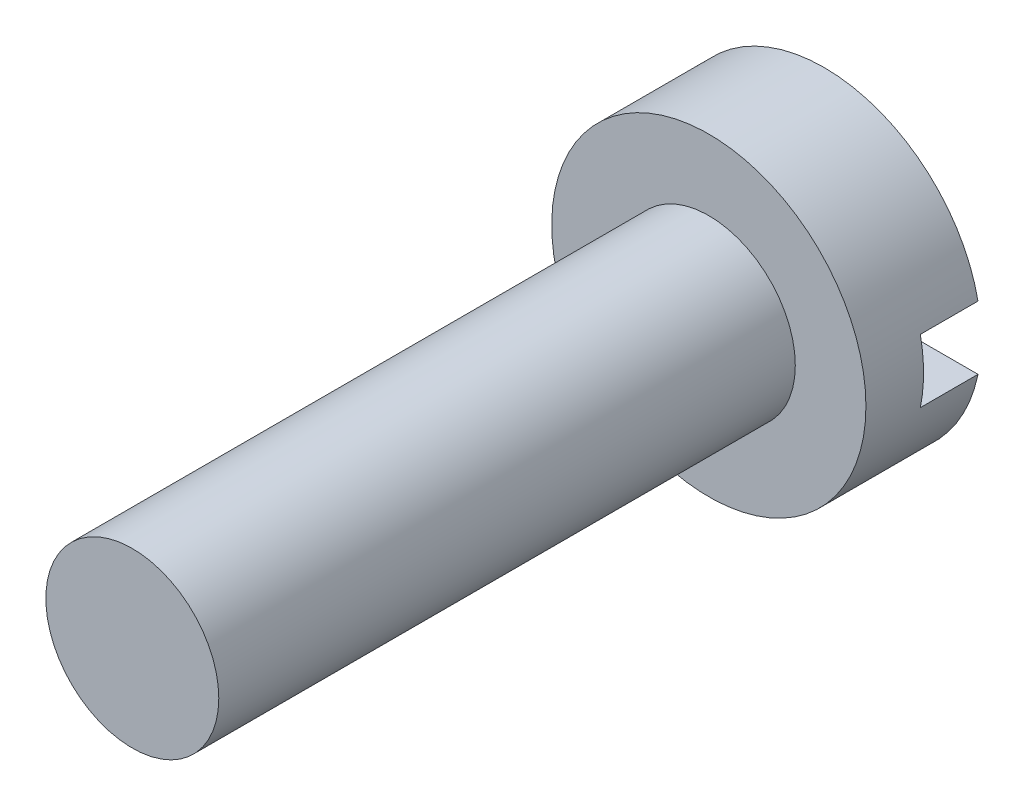
ISO-10303-21;
HEADER;
FILE_DESCRIPTION(('STEP AP214'),'2;1');
FILE_NAME('part.step','',(''),(''),'','','');
FILE_SCHEMA(('AUTOMOTIVE_DESIGN { 1 0 10303 214 1 1 1 1 }'));
ENDSEC;
DATA;
#1=APPLICATION_CONTEXT('core data for automotive mechanical design processes');
#2=APPLICATION_PROTOCOL_DEFINITION('international standard','automotive_design',2000,#1);
#3=PRODUCT_CONTEXT('',#1,'mechanical');
#4=PRODUCT('Part','Part','',(#3));
#5=PRODUCT_RELATED_PRODUCT_CATEGORY('part','',(#4));
#6=PRODUCT_DEFINITION_FORMATION('','',#4);
#7=PRODUCT_DEFINITION_CONTEXT('part definition',#1,'design');
#8=PRODUCT_DEFINITION('design','',#6,#7);
#9=PRODUCT_DEFINITION_SHAPE('','',#8);
#10=(LENGTH_UNIT() NAMED_UNIT(*) SI_UNIT(.MILLI.,.METRE.));
#11=(NAMED_UNIT(*) PLANE_ANGLE_UNIT() SI_UNIT($,.RADIAN.));
#12=(NAMED_UNIT(*) SI_UNIT($,.STERADIAN.) SOLID_ANGLE_UNIT());
#13=UNCERTAINTY_MEASURE_WITH_UNIT(LENGTH_MEASURE(1.E-05),#10,'distance_accuracy_value','');
#14=(GEOMETRIC_REPRESENTATION_CONTEXT(3) GLOBAL_UNCERTAINTY_ASSIGNED_CONTEXT((#13)) GLOBAL_UNIT_ASSIGNED_CONTEXT((#10,
#11,#12)) REPRESENTATION_CONTEXT('',''));
#15=CARTESIAN_POINT('',(0.,0.,0.));
#16=DIRECTION('',(0.,0.,1.));
#17=DIRECTION('',(1.,0.,0.));
#18=AXIS2_PLACEMENT_3D('',#15,#16,#17);
#19=CARTESIAN_POINT('',(0.,0.,0.));
#20=DIRECTION('',(0.,0.,1.));
#21=DIRECTION('',(1.,0.,0.));
#22=AXIS2_PLACEMENT_3D('',#19,#20,#21);
#23=PLANE('',#22);
#24=CARTESIAN_POINT('',(0.,0.,0.));
#25=DIRECTION('',(0.,0.,1.));
#26=DIRECTION('',(1.,0.,0.));
#27=AXIS2_PLACEMENT_3D('',#24,#25,#26);
#28=CIRCLE('',#27,2.725);
#29=CARTESIAN_POINT('',(-2.66891832021889,-0.55,0.));
#30=VERTEX_POINT('',#29);
#31=CARTESIAN_POINT('',(2.66891832021889,-0.55,0.));
#32=VERTEX_POINT('',#31);
#33=EDGE_CURVE('E92',#30,#32,#28,.T.);
#34=ORIENTED_EDGE('',*,*,#33,.F.);
#35=DIRECTION('',(1.,0.,0.));
#36=VECTOR('',#35,1.);
#37=CARTESIAN_POINT('',(0.,-0.55,0.));
#38=LINE('',#37,#36);
#39=EDGE_CURVE('E80',#30,#32,#38,.T.);
#40=ORIENTED_EDGE('',*,*,#39,.T.);
#41=EDGE_LOOP('',(#34,#40));
#42=FACE_BOUND('',#41,.T.);
#43=ADVANCED_FACE('F33',(#42),#23,.F.);
#44=CARTESIAN_POINT('',(0.,0.,2.));
#45=DIRECTION('',(0.,0.,-1.));
#46=DIRECTION('',(-1.,0.,0.));
#47=AXIS2_PLACEMENT_3D('',#44,#45,#46);
#48=CYLINDRICAL_SURFACE('',#47,2.725);
#49=ORIENTED_EDGE('',*,*,#33,.T.);
#50=DIRECTION('',(0.,0.,-1.));
#51=VECTOR('',#50,1.);
#52=CARTESIAN_POINT('',(2.66891832021889,-0.55,2.));
#53=LINE('',#52,#51);
#54=CARTESIAN_POINT('',(2.66891832021889,-0.55,1.));
#55=VERTEX_POINT('',#54);
#56=EDGE_CURVE('E89',#32,#55,#53,.F.);
#57=ORIENTED_EDGE('',*,*,#56,.T.);
#58=CARTESIAN_POINT('',(0.,0.,1.));
#59=DIRECTION('',(0.,0.,-1.));
#60=DIRECTION('',(-1.,0.,0.));
#61=AXIS2_PLACEMENT_3D('',#58,#59,#60);
#62=CIRCLE('',#61,2.725);
#63=CARTESIAN_POINT('',(2.66891832021889,0.55,1.));
#64=VERTEX_POINT('',#63);
#65=EDGE_CURVE('E11',#64,#55,#62,.T.);
#66=ORIENTED_EDGE('',*,*,#65,.F.);
#67=DIRECTION('',(0.,0.,-1.));
#68=VECTOR('',#67,1.);
#69=CARTESIAN_POINT('',(2.66891832021889,0.55,2.));
#70=LINE('',#69,#68);
#71=CARTESIAN_POINT('',(2.66891832021889,0.55,0.));
#72=VERTEX_POINT('',#71);
#73=EDGE_CURVE('E75',#64,#72,#70,.T.);
#74=ORIENTED_EDGE('',*,*,#73,.T.);
#75=CARTESIAN_POINT('',(-2.66891832021889,0.55,0.));
#76=VERTEX_POINT('',#75);
#77=EDGE_CURVE('E87',#72,#76,#28,.T.);
#78=ORIENTED_EDGE('',*,*,#77,.T.);
#79=DIRECTION('',(0.,0.,-1.));
#80=VECTOR('',#79,1.);
#81=CARTESIAN_POINT('',(-2.66891832021889,0.55,2.));
#82=LINE('',#81,#80);
#83=CARTESIAN_POINT('',(-2.66891832021889,0.55,1.));
#84=VERTEX_POINT('',#83);
#85=EDGE_CURVE('E48',#76,#84,#82,.F.);
#86=ORIENTED_EDGE('',*,*,#85,.T.);
#87=CARTESIAN_POINT('',(-2.66891832021889,-0.55,1.));
#88=VERTEX_POINT('',#87);
#89=EDGE_CURVE('E37',#88,#84,#62,.T.);
#90=ORIENTED_EDGE('',*,*,#89,.F.);
#91=DIRECTION('',(0.,0.,-1.));
#92=VECTOR('',#91,1.);
#93=CARTESIAN_POINT('',(-2.66891832021889,-0.55,2.));
#94=LINE('',#93,#92);
#95=EDGE_CURVE('E56',#88,#30,#94,.T.);
#96=ORIENTED_EDGE('',*,*,#95,.T.);
#97=EDGE_LOOP('',(#49,#57,#66,#74,#78,#86,#90,#96));
#98=FACE_BOUND('',#97,.T.);
#99=CARTESIAN_POINT('',(0.,0.,2.));
#100=DIRECTION('',(0.,0.,1.));
#101=DIRECTION('',(1.,0.,0.));
#102=AXIS2_PLACEMENT_3D('',#99,#100,#101);
#103=CIRCLE('',#102,2.725);
#104=CARTESIAN_POINT('',(2.725,0.,2.));
#105=VERTEX_POINT('',#104);
#106=EDGE_CURVE('E81',#105,#105,#103,.T.);
#107=ORIENTED_EDGE('',*,*,#106,.F.);
#108=EDGE_LOOP('',(#107));
#109=FACE_BOUND('',#108,.T.);
#110=ADVANCED_FACE('F35',(#98,#109),#48,.T.);
#111=CARTESIAN_POINT('',(0.,0.,2.));
#112=DIRECTION('',(0.,0.,1.));
#113=DIRECTION('',(1.,0.,0.));
#114=AXIS2_PLACEMENT_3D('',#111,#112,#113);
#115=PLANE('',#114);
#116=CARTESIAN_POINT('',(0.,0.,2.));
#117=DIRECTION('',(0.,0.,1.));
#118=DIRECTION('',(1.,0.,0.));
#119=AXIS2_PLACEMENT_3D('',#116,#117,#118);
#120=CIRCLE('',#119,1.5);
#121=CARTESIAN_POINT('',(1.5,0.,2.));
#122=VERTEX_POINT('',#121);
#123=EDGE_CURVE('E130',#122,#122,#120,.T.);
#124=ORIENTED_EDGE('',*,*,#123,.F.);
#125=EDGE_LOOP('',(#124));
#126=FACE_BOUND('',#125,.T.);
#127=ORIENTED_EDGE('',*,*,#106,.T.);
#128=EDGE_LOOP('',(#127));
#129=FACE_BOUND('',#128,.T.);
#130=ADVANCED_FACE('F115',(#126,#129),#115,.T.);
#131=ORIENTED_EDGE('',*,*,#77,.F.);
#132=DIRECTION('',(-1.,0.,0.));
#133=VECTOR('',#132,1.);
#134=CARTESIAN_POINT('',(0.,0.55,0.));
#135=LINE('',#134,#133);
#136=EDGE_CURVE('E72',#72,#76,#135,.T.);
#137=ORIENTED_EDGE('',*,*,#136,.T.);
#138=EDGE_LOOP('',(#131,#137));
#139=FACE_BOUND('',#138,.T.);
#140=ADVANCED_FACE('F91',(#139),#23,.F.);
#141=CARTESIAN_POINT('',(-3.44980190887808,0.55,1.));
#142=DIRECTION('',(0.,0.,-1.));
#143=DIRECTION('',(-1.,0.,0.));
#144=AXIS2_PLACEMENT_3D('',#141,#142,#143);
#145=PLANE('',#144);
#146=ORIENTED_EDGE('',*,*,#65,.T.);
#147=DIRECTION('',(-1.,0.,0.));
#148=VECTOR('',#147,1.);
#149=CARTESIAN_POINT('',(3.90126958400864,-0.55,1.));
#150=LINE('',#149,#148);
#151=EDGE_CURVE('E105',#55,#88,#150,.T.);
#152=ORIENTED_EDGE('',*,*,#151,.T.);
#153=ORIENTED_EDGE('',*,*,#89,.T.);
#154=DIRECTION('',(1.,0.,0.));
#155=VECTOR('',#154,1.);
#156=CARTESIAN_POINT('',(-3.44980190887808,0.55,1.));
#157=LINE('',#156,#155);
#158=EDGE_CURVE('E104',#84,#64,#157,.T.);
#159=ORIENTED_EDGE('',*,*,#158,.T.);
#160=EDGE_LOOP('',(#146,#152,#153,#159));
#161=FACE_BOUND('',#160,.T.);
#162=ADVANCED_FACE('F103',(#161),#145,.T.);
#163=CARTESIAN_POINT('',(3.90126958400864,-0.55,1.));
#164=DIRECTION('',(0.,-1.,0.));
#165=DIRECTION('',(0.,0.,-1.));
#166=AXIS2_PLACEMENT_3D('',#163,#164,#165);
#167=PLANE('',#166);
#168=ORIENTED_EDGE('',*,*,#151,.F.);
#169=ORIENTED_EDGE('',*,*,#56,.F.);
#170=ORIENTED_EDGE('',*,*,#39,.F.);
#171=ORIENTED_EDGE('',*,*,#95,.F.);
#172=EDGE_LOOP('',(#168,#169,#170,#171));
#173=FACE_BOUND('',#172,.T.);
#174=ADVANCED_FACE('F122',(#173),#167,.F.);
#175=CARTESIAN_POINT('',(-3.44980190887808,0.55,1.));
#176=DIRECTION('',(0.,1.,0.));
#177=DIRECTION('',(0.,0.,1.));
#178=AXIS2_PLACEMENT_3D('',#175,#176,#177);
#179=PLANE('',#178);
#180=ORIENTED_EDGE('',*,*,#158,.F.);
#181=ORIENTED_EDGE('',*,*,#85,.F.);
#182=ORIENTED_EDGE('',*,*,#136,.F.);
#183=ORIENTED_EDGE('',*,*,#73,.F.);
#184=EDGE_LOOP('',(#180,#181,#182,#183));
#185=FACE_BOUND('',#184,.T.);
#186=ADVANCED_FACE('F74',(#185),#179,.F.);
#187=CARTESIAN_POINT('',(0.,0.,12.));
#188=DIRECTION('',(0.,0.,-1.));
#189=DIRECTION('',(-1.,0.,0.));
#190=AXIS2_PLACEMENT_3D('',#187,#188,#189);
#191=CYLINDRICAL_SURFACE('',#190,1.5);
#192=CARTESIAN_POINT('',(0.,0.,12.));
#193=DIRECTION('',(0.,0.,1.));
#194=DIRECTION('',(1.,0.,0.));
#195=AXIS2_PLACEMENT_3D('',#192,#193,#194);
#196=CIRCLE('',#195,1.5);
#197=CARTESIAN_POINT('',(1.5,0.,12.));
#198=VERTEX_POINT('',#197);
#199=EDGE_CURVE('E106',#198,#198,#196,.T.);
#200=ORIENTED_EDGE('',*,*,#199,.F.);
#201=EDGE_LOOP('',(#200));
#202=FACE_BOUND('',#201,.T.);
#203=ORIENTED_EDGE('',*,*,#123,.T.);
#204=EDGE_LOOP('',(#203));
#205=FACE_BOUND('',#204,.T.);
#206=ADVANCED_FACE('F140',(#202,#205),#191,.T.);
#207=CARTESIAN_POINT('',(0.,0.,12.));
#208=DIRECTION('',(0.,0.,1.));
#209=DIRECTION('',(1.,0.,0.));
#210=AXIS2_PLACEMENT_3D('',#207,#208,#209);
#211=PLANE('',#210);
#212=ORIENTED_EDGE('',*,*,#199,.T.);
#213=EDGE_LOOP('',(#212));
#214=FACE_BOUND('',#213,.T.);
#215=ADVANCED_FACE('F138',(#214),#211,.T.);
#216=CLOSED_SHELL('',(#43,#110,#130,#140,#162,#174,#186,#206,#215));
#217=MANIFOLD_SOLID_BREP('B2',#216);
#218=ADVANCED_BREP_SHAPE_REPRESENTATION('',(#18,#217),#14);
#219=SHAPE_DEFINITION_REPRESENTATION(#9,#218);
ENDSEC;
END-ISO-10303-21;
